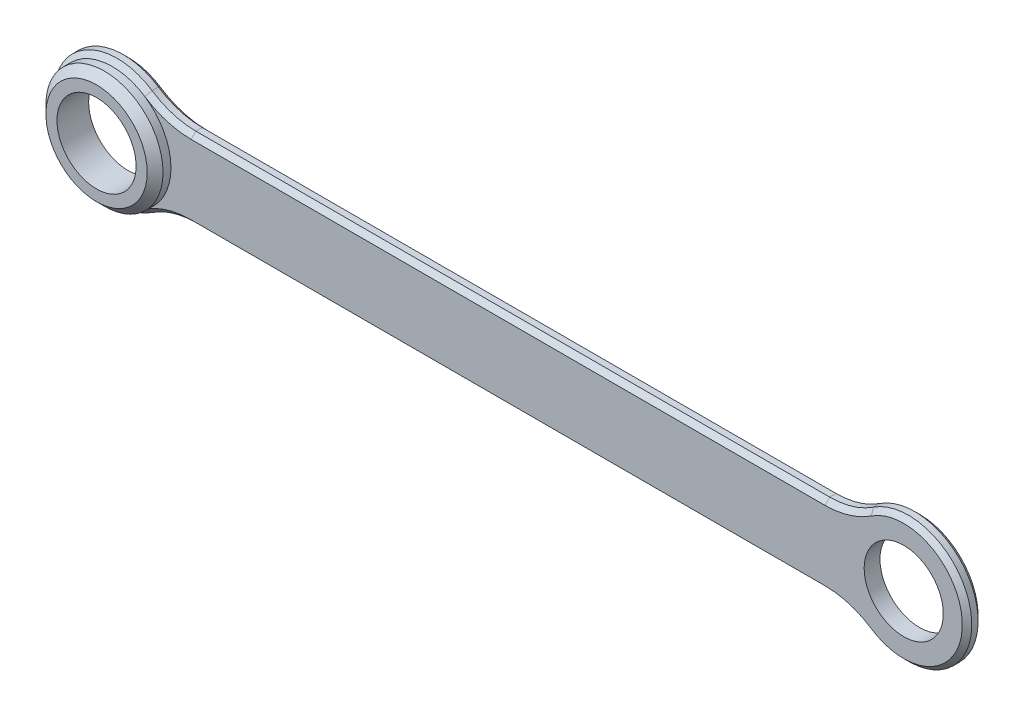
ISO-10303-21;
HEADER;
FILE_DESCRIPTION(('STEP AP214'),'2;1');
FILE_NAME('part.step','',(''),(''),'','','');
FILE_SCHEMA(('AUTOMOTIVE_DESIGN { 1 0 10303 214 1 1 1 1 }'));
ENDSEC;
DATA;
#1=APPLICATION_CONTEXT('core data for automotive mechanical design processes');
#2=APPLICATION_PROTOCOL_DEFINITION('international standard','automotive_design',2000,#1);
#3=PRODUCT_CONTEXT('',#1,'mechanical');
#4=PRODUCT('Part','Part','',(#3));
#5=PRODUCT_RELATED_PRODUCT_CATEGORY('part','',(#4));
#6=PRODUCT_DEFINITION_FORMATION('','',#4);
#7=PRODUCT_DEFINITION_CONTEXT('part definition',#1,'design');
#8=PRODUCT_DEFINITION('design','',#6,#7);
#9=PRODUCT_DEFINITION_SHAPE('','',#8);
#10=(LENGTH_UNIT() NAMED_UNIT(*) SI_UNIT(.MILLI.,.METRE.));
#11=(NAMED_UNIT(*) PLANE_ANGLE_UNIT() SI_UNIT($,.RADIAN.));
#12=(NAMED_UNIT(*) SI_UNIT($,.STERADIAN.) SOLID_ANGLE_UNIT());
#13=UNCERTAINTY_MEASURE_WITH_UNIT(LENGTH_MEASURE(1.E-05),#10,'distance_accuracy_value','');
#14=(GEOMETRIC_REPRESENTATION_CONTEXT(3) GLOBAL_UNCERTAINTY_ASSIGNED_CONTEXT((#13)) GLOBAL_UNIT_ASSIGNED_CONTEXT((#10,
#11,#12)) REPRESENTATION_CONTEXT('',''));
#15=CARTESIAN_POINT('',(0.,0.,0.));
#16=DIRECTION('',(0.,0.,1.));
#17=DIRECTION('',(1.,0.,0.));
#18=AXIS2_PLACEMENT_3D('',#15,#16,#17);
#19=CARTESIAN_POINT('',(0.,0.042307692307692,0.1));
#20=DIRECTION('',(0.,1.,0.));
#21=DIRECTION('',(0.,0.,1.));
#22=AXIS2_PLACEMENT_3D('',#19,#20,#21);
#23=PLANE('',#22);
#24=DIRECTION('',(0.,0.,-1.));
#25=VECTOR('',#24,1.);
#26=CARTESIAN_POINT('',(1.97686525580566,0.042307692307692,0.1));
#27=LINE('',#26,#25);
#28=CARTESIAN_POINT('',(1.97686525580566,0.042307692307692,0.070000000000001));
#29=VERTEX_POINT('',#28);
#30=CARTESIAN_POINT('',(1.97686525580566,0.042307692307692,0.0300000000000012));
#31=VERTEX_POINT('',#30);
#32=EDGE_CURVE('E248',#29,#31,#27,.T.);
#33=ORIENTED_EDGE('',*,*,#32,.T.);
#34=DIRECTION('',(-1.,0.,0.));
#35=VECTOR('',#34,1.);
#36=CARTESIAN_POINT('',(-2.02814730708772,0.042307692307692,0.0300000000000012));
#37=LINE('',#36,#35);
#38=CARTESIAN_POINT('',(-2.02814730708772,0.042307692307692,0.0300000000000012));
#39=VERTEX_POINT('',#38);
#40=EDGE_CURVE('E95',#31,#39,#37,.T.);
#41=ORIENTED_EDGE('',*,*,#40,.T.);
#42=DIRECTION('',(0.,0.,-1.));
#43=VECTOR('',#42,1.);
#44=CARTESIAN_POINT('',(-2.02814730708772,0.042307692307692,0.1));
#45=LINE('',#44,#43);
#46=CARTESIAN_POINT('',(-2.02814730708772,0.042307692307692,0.070000000000001));
#47=VERTEX_POINT('',#46);
#48=EDGE_CURVE('E261',#39,#47,#45,.F.);
#49=ORIENTED_EDGE('',*,*,#48,.T.);
#50=DIRECTION('',(1.,0.,0.));
#51=VECTOR('',#50,1.);
#52=CARTESIAN_POINT('',(0.,0.042307692307692,0.070000000000001));
#53=LINE('',#52,#51);
#54=EDGE_CURVE('E292',#47,#29,#53,.T.);
#55=ORIENTED_EDGE('',*,*,#54,.T.);
#56=EDGE_LOOP('',(#33,#41,#49,#55));
#57=FACE_BOUND('',#56,.T.);
#58=ADVANCED_FACE('F71',(#57),#23,.T.);
#59=CARTESIAN_POINT('',(0.,-0.457692307692308,0.1));
#60=DIRECTION('',(0.,1.,0.));
#61=DIRECTION('',(-1.,0.,0.));
#62=AXIS2_PLACEMENT_3D('',#59,#60,#61);
#63=PLANE('',#62);
#64=DIRECTION('',(0.,0.,1.));
#65=VECTOR('',#64,1.);
#66=CARTESIAN_POINT('',(-2.02814730708772,-0.457692307692308,0.));
#67=LINE('',#66,#65);
#68=CARTESIAN_POINT('',(-2.02814730708772,-0.457692307692308,0.070000000000001));
#69=VERTEX_POINT('',#68);
#70=CARTESIAN_POINT('',(-2.02814730708772,-0.457692307692308,0.0300000000000012));
#71=VERTEX_POINT('',#70);
#72=EDGE_CURVE('E267',#69,#71,#67,.F.);
#73=ORIENTED_EDGE('',*,*,#72,.T.);
#74=DIRECTION('',(1.,0.,0.));
#75=VECTOR('',#74,1.);
#76=CARTESIAN_POINT('',(0.,-0.457692307692308,0.0300000000000012));
#77=LINE('',#76,#75);
#78=CARTESIAN_POINT('',(1.97686525580566,-0.457692307692308,0.0300000000000012));
#79=VERTEX_POINT('',#78);
#80=EDGE_CURVE('E368',#71,#79,#77,.T.);
#81=ORIENTED_EDGE('',*,*,#80,.T.);
#82=DIRECTION('',(0.,0.,1.));
#83=VECTOR('',#82,1.);
#84=CARTESIAN_POINT('',(1.97686525580566,-0.457692307692308,0.1));
#85=LINE('',#84,#83);
#86=CARTESIAN_POINT('',(1.97686525580566,-0.457692307692308,0.070000000000001));
#87=VERTEX_POINT('',#86);
#88=EDGE_CURVE('E264',#79,#87,#85,.T.);
#89=ORIENTED_EDGE('',*,*,#88,.T.);
#90=DIRECTION('',(-1.,0.,0.));
#91=VECTOR('',#90,1.);
#92=CARTESIAN_POINT('',(-2.02814730708772,-0.457692307692308,0.070000000000001));
#93=LINE('',#92,#91);
#94=EDGE_CURVE('E306',#87,#69,#93,.T.);
#95=ORIENTED_EDGE('',*,*,#94,.T.);
#96=EDGE_LOOP('',(#73,#81,#89,#95));
#97=FACE_BOUND('',#96,.T.);
#98=ADVANCED_FACE('F456',(#97),#63,.F.);
#99=CARTESIAN_POINT('',(0.,0.,0.));
#100=DIRECTION('',(0.,0.,1.));
#101=DIRECTION('',(1.,0.,0.));
#102=AXIS2_PLACEMENT_3D('',#99,#100,#101);
#103=PLANE('',#102);
#104=CARTESIAN_POINT('',(2.47435897435897,-0.207692307692308,0.));
#105=DIRECTION('',(0.,0.,1.));
#106=DIRECTION('',(1.,0.,0.));
#107=AXIS2_PLACEMENT_3D('',#104,#105,#106);
#108=CIRCLE('',#107,0.25);
#109=CARTESIAN_POINT('',(2.72435897435897,-0.207692307692308,0.));
#110=VERTEX_POINT('',#109);
#111=EDGE_CURVE('E243',#110,#110,#108,.T.);
#112=ORIENTED_EDGE('',*,*,#111,.T.);
#113=EDGE_LOOP('',(#112));
#114=FACE_BOUND('',#113,.T.);
#115=CARTESIAN_POINT('',(-2.52564102564103,-0.207692307692308,0.));
#116=DIRECTION('',(0.,0.,1.));
#117=DIRECTION('',(1.,0.,0.));
#118=AXIS2_PLACEMENT_3D('',#115,#116,#117);
#119=CIRCLE('',#118,0.25);
#120=CARTESIAN_POINT('',(-2.27564102564103,-0.207692307692308,0.));
#121=VERTEX_POINT('',#120);
#122=EDGE_CURVE('E239',#121,#121,#119,.T.);
#123=ORIENTED_EDGE('',*,*,#122,.T.);
#124=EDGE_LOOP('',(#123));
#125=FACE_BOUND('',#124,.T.);
#126=DIRECTION('',(-1.,0.,0.));
#127=VECTOR('',#126,1.);
#128=CARTESIAN_POINT('',(0.,-0.427692307692306,0.));
#129=LINE('',#128,#127);
#130=CARTESIAN_POINT('',(1.97686525580566,-0.427692307692306,0.));
#131=VERTEX_POINT('',#130);
#132=CARTESIAN_POINT('',(-2.02814730708772,-0.427692307692306,0.));
#133=VERTEX_POINT('',#132);
#134=EDGE_CURVE('E357',#131,#133,#129,.T.);
#135=ORIENTED_EDGE('',*,*,#134,.T.);
#136=CARTESIAN_POINT('',(-2.02814730708772,-0.957692307692308,0.));
#137=DIRECTION('',(0.,0.,1.));
#138=DIRECTION('',(1.,0.,0.));
#139=AXIS2_PLACEMENT_3D('',#136,#137,#138);
#140=CIRCLE('',#139,0.530000000000002);
#141=CARTESIAN_POINT('',(-2.32111583023578,-0.51602564102564,0.));
#142=VERTEX_POINT('',#141);
#143=EDGE_CURVE('E360',#133,#142,#140,.T.);
#144=ORIENTED_EDGE('',*,*,#143,.T.);
#145=CARTESIAN_POINT('',(-2.52564102564103,-0.207692307692308,0.));
#146=DIRECTION('',(0.,0.,1.));
#147=DIRECTION('',(1.,0.,0.));
#148=AXIS2_PLACEMENT_3D('',#145,#146,#147);
#149=CIRCLE('',#148,0.369999999999998);
#150=CARTESIAN_POINT('',(-2.32111583023578,0.100641025641024,0.));
#151=VERTEX_POINT('',#150);
#152=EDGE_CURVE('E315',#142,#151,#149,.F.);
#153=ORIENTED_EDGE('',*,*,#152,.T.);
#154=CARTESIAN_POINT('',(-2.02814730708772,0.542307692307692,0.));
#155=DIRECTION('',(0.,0.,1.));
#156=DIRECTION('',(1.,0.,0.));
#157=AXIS2_PLACEMENT_3D('',#154,#155,#156);
#158=CIRCLE('',#157,0.530000000000002);
#159=CARTESIAN_POINT('',(-2.02814730708772,0.0123076923076902,0.));
#160=VERTEX_POINT('',#159);
#161=EDGE_CURVE('E342',#151,#160,#158,.T.);
#162=ORIENTED_EDGE('',*,*,#161,.T.);
#163=DIRECTION('',(1.,0.,0.));
#164=VECTOR('',#163,1.);
#165=CARTESIAN_POINT('',(1.97686525580566,0.0123076923076902,0.));
#166=LINE('',#165,#164);
#167=CARTESIAN_POINT('',(1.97686525580566,0.0123076923076902,0.));
#168=VERTEX_POINT('',#167);
#169=EDGE_CURVE('E345',#160,#168,#166,.T.);
#170=ORIENTED_EDGE('',*,*,#169,.T.);
#171=CARTESIAN_POINT('',(1.97686525580566,0.542307692307692,0.));
#172=DIRECTION('',(0.,0.,1.));
#173=DIRECTION('',(1.,0.,0.));
#174=AXIS2_PLACEMENT_3D('',#171,#172,#173);
#175=CIRCLE('',#174,0.530000000000002);
#176=CARTESIAN_POINT('',(2.26983377895372,0.100641025641024,0.));
#177=VERTEX_POINT('',#176);
#178=EDGE_CURVE('E348',#168,#177,#175,.T.);
#179=ORIENTED_EDGE('',*,*,#178,.T.);
#180=CARTESIAN_POINT('',(2.47435897435897,-0.207692307692308,0.));
#181=DIRECTION('',(0.,0.,1.));
#182=DIRECTION('',(1.,0.,0.));
#183=AXIS2_PLACEMENT_3D('',#180,#181,#182);
#184=CIRCLE('',#183,0.369999999999998);
#185=CARTESIAN_POINT('',(2.26983377895373,-0.51602564102564,0.));
#186=VERTEX_POINT('',#185);
#187=EDGE_CURVE('E351',#177,#186,#184,.F.);
#188=ORIENTED_EDGE('',*,*,#187,.T.);
#189=CARTESIAN_POINT('',(1.97686525580566,-0.957692307692308,0.));
#190=DIRECTION('',(0.,0.,1.));
#191=DIRECTION('',(1.,0.,0.));
#192=AXIS2_PLACEMENT_3D('',#189,#190,#191);
#193=CIRCLE('',#192,0.530000000000002);
#194=EDGE_CURVE('E354',#186,#131,#193,.T.);
#195=ORIENTED_EDGE('',*,*,#194,.T.);
#196=EDGE_LOOP('',(#135,#144,#153,#162,#170,#179,#188,#195));
#197=FACE_BOUND('',#196,.T.);
#198=ADVANCED_FACE('F493',(#114,#125,#197),#103,.F.);
#199=CARTESIAN_POINT('',(0.,0.,0.1));
#200=DIRECTION('',(0.,0.,1.));
#201=DIRECTION('',(1.,0.,0.));
#202=AXIS2_PLACEMENT_3D('',#199,#200,#201);
#203=PLANE('',#202);
#204=CARTESIAN_POINT('',(-2.52564102564103,-0.207692307692308,0.1));
#205=DIRECTION('',(0.,0.,1.));
#206=DIRECTION('',(1.,0.,0.));
#207=AXIS2_PLACEMENT_3D('',#204,#205,#206);
#208=CIRCLE('',#207,0.370000000000001);
#209=CARTESIAN_POINT('',(-2.32111583023578,-0.516025641025642,0.1));
#210=VERTEX_POINT('',#209);
#211=CARTESIAN_POINT('',(-2.32111583023578,0.100641025641027,0.1));
#212=VERTEX_POINT('',#211);
#213=EDGE_CURVE('E191',#210,#212,#208,.T.);
#214=ORIENTED_EDGE('',*,*,#213,.F.);
#215=CARTESIAN_POINT('',(-2.02814730708772,-0.957692307692308,0.1));
#216=DIRECTION('',(0.,0.,1.));
#217=DIRECTION('',(1.,0.,0.));
#218=AXIS2_PLACEMENT_3D('',#215,#216,#217);
#219=CIRCLE('',#218,0.529999999999999);
#220=CARTESIAN_POINT('',(-2.02814730708772,-0.427692307692309,0.1));
#221=VERTEX_POINT('',#220);
#222=EDGE_CURVE('E214',#210,#221,#219,.F.);
#223=ORIENTED_EDGE('',*,*,#222,.T.);
#224=DIRECTION('',(1.,0.,0.));
#225=VECTOR('',#224,1.);
#226=CARTESIAN_POINT('',(1.97686525580566,-0.427692307692309,0.1));
#227=LINE('',#226,#225);
#228=CARTESIAN_POINT('',(1.97686525580566,-0.427692307692309,0.1));
#229=VERTEX_POINT('',#228);
#230=EDGE_CURVE('E276',#221,#229,#227,.T.);
#231=ORIENTED_EDGE('',*,*,#230,.T.);
#232=CARTESIAN_POINT('',(1.97686525580566,-0.957692307692308,0.1));
#233=DIRECTION('',(0.,0.,1.));
#234=DIRECTION('',(1.,0.,0.));
#235=AXIS2_PLACEMENT_3D('',#232,#233,#234);
#236=CIRCLE('',#235,0.529999999999999);
#237=CARTESIAN_POINT('',(2.26983377895372,-0.516025641025642,0.1));
#238=VERTEX_POINT('',#237);
#239=EDGE_CURVE('E279',#229,#238,#236,.F.);
#240=ORIENTED_EDGE('',*,*,#239,.T.);
#241=CARTESIAN_POINT('',(2.47435897435897,-0.207692307692308,0.1));
#242=DIRECTION('',(0.,0.,1.));
#243=DIRECTION('',(1.,0.,0.));
#244=AXIS2_PLACEMENT_3D('',#241,#242,#243);
#245=CIRCLE('',#244,0.370000000000001);
#246=CARTESIAN_POINT('',(2.26983377895372,0.100641025641027,0.1));
#247=VERTEX_POINT('',#246);
#248=EDGE_CURVE('E282',#238,#247,#245,.T.);
#249=ORIENTED_EDGE('',*,*,#248,.T.);
#250=CARTESIAN_POINT('',(1.97686525580566,0.542307692307692,0.1));
#251=DIRECTION('',(0.,0.,1.));
#252=DIRECTION('',(1.,0.,0.));
#253=AXIS2_PLACEMENT_3D('',#250,#251,#252);
#254=CIRCLE('',#253,0.529999999999999);
#255=CARTESIAN_POINT('',(1.97686525580566,0.0123076923076931,0.1));
#256=VERTEX_POINT('',#255);
#257=EDGE_CURVE('E285',#247,#256,#254,.F.);
#258=ORIENTED_EDGE('',*,*,#257,.T.);
#259=DIRECTION('',(-1.,0.,0.));
#260=VECTOR('',#259,1.);
#261=CARTESIAN_POINT('',(0.,0.0123076923076932,0.1));
#262=LINE('',#261,#260);
#263=CARTESIAN_POINT('',(-2.02814730708772,0.0123076923076932,0.1));
#264=VERTEX_POINT('',#263);
#265=EDGE_CURVE('E194',#256,#264,#262,.T.);
#266=ORIENTED_EDGE('',*,*,#265,.T.);
#267=CARTESIAN_POINT('',(-2.02814730708772,0.542307692307692,0.1));
#268=DIRECTION('',(0.,0.,1.));
#269=DIRECTION('',(1.,0.,0.));
#270=AXIS2_PLACEMENT_3D('',#267,#268,#269);
#271=CIRCLE('',#270,0.529999999999999);
#272=EDGE_CURVE('E186',#264,#212,#271,.F.);
#273=ORIENTED_EDGE('',*,*,#272,.T.);
#274=EDGE_LOOP('',(#214,#223,#231,#240,#249,#258,#266,#273));
#275=FACE_BOUND('',#274,.T.);
#276=CARTESIAN_POINT('',(2.47435897435897,-0.207692307692308,0.1));
#277=DIRECTION('',(0.,0.,-1.));
#278=DIRECTION('',(-1.,0.,0.));
#279=AXIS2_PLACEMENT_3D('',#276,#277,#278);
#280=CIRCLE('',#279,0.25);
#281=CARTESIAN_POINT('',(2.22435897435897,-0.207692307692308,0.1));
#282=VERTEX_POINT('',#281);
#283=EDGE_CURVE('E235',#282,#282,#280,.T.);
#284=ORIENTED_EDGE('',*,*,#283,.T.);
#285=EDGE_LOOP('',(#284));
#286=FACE_BOUND('',#285,.T.);
#287=ADVANCED_FACE('F188',(#275,#286),#203,.T.);
#288=CARTESIAN_POINT('',(2.47435897435897,-0.207692307692308,0.1));
#289=DIRECTION('',(0.,0.,-1.));
#290=DIRECTION('',(-1.,0.,0.));
#291=AXIS2_PLACEMENT_3D('',#288,#289,#290);
#292=CYLINDRICAL_SURFACE('',#291,0.4);
#293=DIRECTION('',(0.,0.,-1.));
#294=VECTOR('',#293,1.);
#295=CARTESIAN_POINT('',(2.25325065500195,-0.541025641025642,0.1));
#296=LINE('',#295,#294);
#297=CARTESIAN_POINT('',(2.25325065500195,-0.541025641025642,0.070000000000001));
#298=VERTEX_POINT('',#297);
#299=CARTESIAN_POINT('',(2.25325065500195,-0.541025641025642,0.0300000000000012));
#300=VERTEX_POINT('',#299);
#301=EDGE_CURVE('E215',#298,#300,#296,.T.);
#302=ORIENTED_EDGE('',*,*,#301,.T.);
#303=CARTESIAN_POINT('',(2.47435897435897,-0.207692307692308,0.0300000000000012));
#304=DIRECTION('',(0.,0.,1.));
#305=DIRECTION('',(1.,0.,0.));
#306=AXIS2_PLACEMENT_3D('',#303,#304,#305);
#307=CIRCLE('',#306,0.4);
#308=CARTESIAN_POINT('',(2.25325065500195,0.125641025641025,0.0300000000000012));
#309=VERTEX_POINT('',#308);
#310=EDGE_CURVE('E374',#300,#309,#307,.T.);
#311=ORIENTED_EDGE('',*,*,#310,.T.);
#312=DIRECTION('',(0.,0.,-1.));
#313=VECTOR('',#312,1.);
#314=CARTESIAN_POINT('',(2.25325065500195,0.125641025641025,0.1));
#315=LINE('',#314,#313);
#316=CARTESIAN_POINT('',(2.25325065500195,0.125641025641025,0.070000000000001));
#317=VERTEX_POINT('',#316);
#318=EDGE_CURVE('E251',#309,#317,#315,.F.);
#319=ORIENTED_EDGE('',*,*,#318,.T.);
#320=CARTESIAN_POINT('',(2.47435897435897,-0.207692307692308,0.070000000000001));
#321=DIRECTION('',(0.,0.,1.));
#322=DIRECTION('',(1.,0.,0.));
#323=AXIS2_PLACEMENT_3D('',#320,#321,#322);
#324=CIRCLE('',#323,0.4);
#325=EDGE_CURVE('E299',#317,#298,#324,.F.);
#326=ORIENTED_EDGE('',*,*,#325,.T.);
#327=EDGE_LOOP('',(#302,#311,#319,#326));
#328=FACE_BOUND('',#327,.T.);
#329=ADVANCED_FACE('F481',(#328),#292,.T.);
#330=CARTESIAN_POINT('',(-2.52564102564103,-0.207692307692308,0.1));
#331=DIRECTION('',(0.,0.,-1.));
#332=DIRECTION('',(-1.,0.,0.));
#333=AXIS2_PLACEMENT_3D('',#330,#331,#332);
#334=CYLINDRICAL_SURFACE('',#333,0.4);
#335=DIRECTION('',(0.,0.,-1.));
#336=VECTOR('',#335,1.);
#337=CARTESIAN_POINT('',(-2.304532706284,0.125641025641025,0.1));
#338=LINE('',#337,#336);
#339=CARTESIAN_POINT('',(-2.304532706284,0.125641025641025,0.070000000000001));
#340=VERTEX_POINT('',#339);
#341=CARTESIAN_POINT('',(-2.304532706284,0.125641025641025,0.0300000000000012));
#342=VERTEX_POINT('',#341);
#343=EDGE_CURVE('E258',#340,#342,#338,.T.);
#344=ORIENTED_EDGE('',*,*,#343,.T.);
#345=CARTESIAN_POINT('',(-2.52564102564103,-0.207692307692308,0.0300000000000012));
#346=DIRECTION('',(0.,0.,1.));
#347=DIRECTION('',(1.,0.,0.));
#348=AXIS2_PLACEMENT_3D('',#345,#346,#347);
#349=CIRCLE('',#348,0.4);
#350=CARTESIAN_POINT('',(-2.304532706284,-0.541025641025641,0.0300000000000012));
#351=VERTEX_POINT('',#350);
#352=EDGE_CURVE('E226',#342,#351,#349,.T.);
#353=ORIENTED_EDGE('',*,*,#352,.T.);
#354=DIRECTION('',(0.,0.,-1.));
#355=VECTOR('',#354,1.);
#356=CARTESIAN_POINT('',(-2.304532706284,-0.541025641025641,0.1));
#357=LINE('',#356,#355);
#358=CARTESIAN_POINT('',(-2.304532706284,-0.541025641025641,0.070000000000001));
#359=VERTEX_POINT('',#358);
#360=EDGE_CURVE('E255',#351,#359,#357,.F.);
#361=ORIENTED_EDGE('',*,*,#360,.T.);
#362=CARTESIAN_POINT('',(-2.52564102564103,-0.207692307692308,0.070000000000001));
#363=DIRECTION('',(0.,0.,1.));
#364=DIRECTION('',(1.,0.,0.));
#365=AXIS2_PLACEMENT_3D('',#362,#363,#364);
#366=CIRCLE('',#365,0.4);
#367=EDGE_CURVE('E313',#359,#340,#366,.F.);
#368=ORIENTED_EDGE('',*,*,#367,.T.);
#369=EDGE_LOOP('',(#344,#353,#361,#368));
#370=FACE_BOUND('',#369,.T.);
#371=ADVANCED_FACE('F435',(#370),#334,.T.);
#372=CARTESIAN_POINT('',(1.97686525580566,0.542307692307692,0.1));
#373=DIRECTION('',(0.,0.,-1.));
#374=DIRECTION('',(-1.,0.,0.));
#375=AXIS2_PLACEMENT_3D('',#372,#373,#374);
#376=CYLINDRICAL_SURFACE('',#375,0.5);
#377=ORIENTED_EDGE('',*,*,#318,.F.);
#378=CARTESIAN_POINT('',(1.97686525580566,0.542307692307692,0.0300000000000012));
#379=DIRECTION('',(0.,0.,1.));
#380=DIRECTION('',(1.,0.,0.));
#381=AXIS2_PLACEMENT_3D('',#378,#379,#380);
#382=CIRCLE('',#381,0.5);
#383=EDGE_CURVE('E377',#309,#31,#382,.F.);
#384=ORIENTED_EDGE('',*,*,#383,.T.);
#385=ORIENTED_EDGE('',*,*,#32,.F.);
#386=CARTESIAN_POINT('',(1.97686525580566,0.542307692307692,0.070000000000001));
#387=DIRECTION('',(0.,0.,1.));
#388=DIRECTION('',(1.,0.,0.));
#389=AXIS2_PLACEMENT_3D('',#386,#387,#388);
#390=CIRCLE('',#389,0.5);
#391=EDGE_CURVE('E295',#29,#317,#390,.T.);
#392=ORIENTED_EDGE('',*,*,#391,.T.);
#393=EDGE_LOOP('',(#377,#384,#385,#392));
#394=FACE_BOUND('',#393,.T.);
#395=ADVANCED_FACE('F425',(#394),#376,.F.);
#396=CARTESIAN_POINT('',(-2.02814730708772,0.542307692307692,0.1));
#397=DIRECTION('',(0.,0.,-1.));
#398=DIRECTION('',(-1.,0.,0.));
#399=AXIS2_PLACEMENT_3D('',#396,#397,#398);
#400=CYLINDRICAL_SURFACE('',#399,0.5);
#401=ORIENTED_EDGE('',*,*,#48,.F.);
#402=CARTESIAN_POINT('',(-2.02814730708772,0.542307692307692,0.0300000000000012));
#403=DIRECTION('',(0.,0.,1.));
#404=DIRECTION('',(1.,0.,0.));
#405=AXIS2_PLACEMENT_3D('',#402,#403,#404);
#406=CIRCLE('',#405,0.5);
#407=EDGE_CURVE('E87',#39,#342,#406,.F.);
#408=ORIENTED_EDGE('',*,*,#407,.T.);
#409=ORIENTED_EDGE('',*,*,#343,.F.);
#410=CARTESIAN_POINT('',(-2.02814730708772,0.542307692307692,0.070000000000001));
#411=DIRECTION('',(0.,0.,1.));
#412=DIRECTION('',(1.,0.,0.));
#413=AXIS2_PLACEMENT_3D('',#410,#411,#412);
#414=CIRCLE('',#413,0.5);
#415=EDGE_CURVE('E200',#340,#47,#414,.T.);
#416=ORIENTED_EDGE('',*,*,#415,.T.);
#417=EDGE_LOOP('',(#401,#408,#409,#416));
#418=FACE_BOUND('',#417,.T.);
#419=ADVANCED_FACE('F431',(#418),#400,.F.);
#420=CARTESIAN_POINT('',(-2.02814730708772,-0.957692307692308,0.1));
#421=DIRECTION('',(0.,0.,-1.));
#422=DIRECTION('',(-1.,0.,0.));
#423=AXIS2_PLACEMENT_3D('',#420,#421,#422);
#424=CYLINDRICAL_SURFACE('',#423,0.5);
#425=ORIENTED_EDGE('',*,*,#360,.F.);
#426=CARTESIAN_POINT('',(-2.02814730708772,-0.957692307692308,0.0300000000000012));
#427=DIRECTION('',(0.,0.,1.));
#428=DIRECTION('',(1.,0.,0.));
#429=AXIS2_PLACEMENT_3D('',#426,#427,#428);
#430=CIRCLE('',#429,0.5);
#431=EDGE_CURVE('E364',#351,#71,#430,.F.);
#432=ORIENTED_EDGE('',*,*,#431,.T.);
#433=ORIENTED_EDGE('',*,*,#72,.F.);
#434=CARTESIAN_POINT('',(-2.02814730708772,-0.957692307692308,0.070000000000001));
#435=DIRECTION('',(0.,0.,1.));
#436=DIRECTION('',(1.,0.,0.));
#437=AXIS2_PLACEMENT_3D('',#434,#435,#436);
#438=CIRCLE('',#437,0.5);
#439=EDGE_CURVE('E309',#69,#359,#438,.T.);
#440=ORIENTED_EDGE('',*,*,#439,.T.);
#441=EDGE_LOOP('',(#425,#432,#433,#440));
#442=FACE_BOUND('',#441,.T.);
#443=ADVANCED_FACE('F453',(#442),#424,.F.);
#444=CARTESIAN_POINT('',(1.97686525580566,-0.957692307692308,0.1));
#445=DIRECTION('',(0.,0.,-1.));
#446=DIRECTION('',(-1.,0.,0.));
#447=AXIS2_PLACEMENT_3D('',#444,#445,#446);
#448=CYLINDRICAL_SURFACE('',#447,0.5);
#449=ORIENTED_EDGE('',*,*,#88,.F.);
#450=CARTESIAN_POINT('',(1.97686525580566,-0.957692307692308,0.0300000000000012));
#451=DIRECTION('',(0.,0.,1.));
#452=DIRECTION('',(1.,0.,0.));
#453=AXIS2_PLACEMENT_3D('',#450,#451,#452);
#454=CIRCLE('',#453,0.5);
#455=EDGE_CURVE('E371',#79,#300,#454,.F.);
#456=ORIENTED_EDGE('',*,*,#455,.T.);
#457=ORIENTED_EDGE('',*,*,#301,.F.);
#458=CARTESIAN_POINT('',(1.97686525580566,-0.957692307692308,0.070000000000001));
#459=DIRECTION('',(0.,0.,1.));
#460=DIRECTION('',(1.,0.,0.));
#461=AXIS2_PLACEMENT_3D('',#458,#459,#460);
#462=CIRCLE('',#461,0.5);
#463=EDGE_CURVE('E302',#298,#87,#462,.T.);
#464=ORIENTED_EDGE('',*,*,#463,.T.);
#465=EDGE_LOOP('',(#449,#456,#457,#464));
#466=FACE_BOUND('',#465,.T.);
#467=ADVANCED_FACE('F483',(#466),#448,.F.);
#468=CARTESIAN_POINT('',(1.97686525580566,-0.957692307692308,0.1));
#469=DIRECTION('',(0.,0.,1.));
#470=DIRECTION('',(1.,0.,0.));
#471=AXIS2_PLACEMENT_3D('',#468,#469,#470);
#472=CONICAL_SURFACE('',#471,0.529999999999999,0.785398163397445);
#473=DIRECTION('',(0.,0.707106781186545,0.70710678118655));
#474=VECTOR('',#473,1.);
#475=CARTESIAN_POINT('',(1.97686525580566,-0.457692307692308,0.070000000000001));
#476=LINE('',#475,#474);
#477=EDGE_CURVE('E333',#87,#229,#476,.T.);
#478=ORIENTED_EDGE('',*,*,#477,.F.);
#479=ORIENTED_EDGE('',*,*,#463,.F.);
#480=DIRECTION('',(-0.390867979985288,-0.589255650988785,-0.70710678118655));
#481=VECTOR('',#480,1.);
#482=CARTESIAN_POINT('',(2.26983377895372,-0.516025641025642,0.1));
#483=LINE('',#482,#481);
#484=EDGE_CURVE('E252',#238,#298,#483,.T.);
#485=ORIENTED_EDGE('',*,*,#484,.F.);
#486=ORIENTED_EDGE('',*,*,#239,.F.);
#487=EDGE_LOOP('',(#478,#479,#485,#486));
#488=FACE_BOUND('',#487,.T.);
#489=ADVANCED_FACE('F469',(#488),#472,.F.);
#490=CARTESIAN_POINT('',(2.47435897435897,-0.207692307692308,0.1));
#491=DIRECTION('',(0.,0.,-1.));
#492=DIRECTION('',(-1.,0.,0.));
#493=AXIS2_PLACEMENT_3D('',#490,#491,#492);
#494=CONICAL_SURFACE('',#493,0.370000000000001,0.785398163397445);
#495=ORIENTED_EDGE('',*,*,#484,.T.);
#496=ORIENTED_EDGE('',*,*,#325,.F.);
#497=DIRECTION('',(-0.390867979985288,0.589255650988785,-0.70710678118655));
#498=VECTOR('',#497,1.);
#499=CARTESIAN_POINT('',(2.26983377895372,0.100641025641027,0.1));
#500=LINE('',#499,#498);
#501=EDGE_CURVE('E329',#247,#317,#500,.T.);
#502=ORIENTED_EDGE('',*,*,#501,.F.);
#503=ORIENTED_EDGE('',*,*,#248,.F.);
#504=EDGE_LOOP('',(#495,#496,#502,#503));
#505=FACE_BOUND('',#504,.T.);
#506=ADVANCED_FACE('F475',(#505),#494,.T.);
#507=CARTESIAN_POINT('',(0.,-0.427692307692309,0.1));
#508=DIRECTION('',(0.,-0.70710678118655,0.707106781186545));
#509=DIRECTION('',(-1.,0.,0.));
#510=AXIS2_PLACEMENT_3D('',#507,#508,#509);
#511=PLANE('',#510);
#512=ORIENTED_EDGE('',*,*,#477,.T.);
#513=ORIENTED_EDGE('',*,*,#230,.F.);
#514=DIRECTION('',(0.,0.707106781186545,0.70710678118655));
#515=VECTOR('',#514,1.);
#516=CARTESIAN_POINT('',(-2.02814730708772,-0.457692307692308,0.070000000000001));
#517=LINE('',#516,#515);
#518=EDGE_CURVE('E325',#69,#221,#517,.T.);
#519=ORIENTED_EDGE('',*,*,#518,.F.);
#520=ORIENTED_EDGE('',*,*,#94,.F.);
#521=EDGE_LOOP('',(#512,#513,#519,#520));
#522=FACE_BOUND('',#521,.T.);
#523=ADVANCED_FACE('F460',(#522),#511,.T.);
#524=CARTESIAN_POINT('',(1.97686525580566,0.542307692307692,0.1));
#525=DIRECTION('',(0.,0.,1.));
#526=DIRECTION('',(1.,0.,0.));
#527=AXIS2_PLACEMENT_3D('',#524,#525,#526);
#528=CONICAL_SURFACE('',#527,0.529999999999999,0.785398163397445);
#529=ORIENTED_EDGE('',*,*,#501,.T.);
#530=ORIENTED_EDGE('',*,*,#391,.F.);
#531=DIRECTION('',(0.,0.707106781186546,-0.707106781186549));
#532=VECTOR('',#531,1.);
#533=CARTESIAN_POINT('',(1.97686525580566,0.0123076923076931,0.1));
#534=LINE('',#533,#532);
#535=EDGE_CURVE('E321',#256,#29,#534,.T.);
#536=ORIENTED_EDGE('',*,*,#535,.F.);
#537=ORIENTED_EDGE('',*,*,#257,.F.);
#538=EDGE_LOOP('',(#529,#530,#536,#537));
#539=FACE_BOUND('',#538,.T.);
#540=ADVANCED_FACE('F478',(#539),#528,.F.);
#541=CARTESIAN_POINT('',(-2.02814730708772,-0.957692307692308,0.1));
#542=DIRECTION('',(0.,0.,1.));
#543=DIRECTION('',(1.,0.,0.));
#544=AXIS2_PLACEMENT_3D('',#541,#542,#543);
#545=CONICAL_SURFACE('',#544,0.529999999999999,0.785398163397445);
#546=ORIENTED_EDGE('',*,*,#518,.T.);
#547=ORIENTED_EDGE('',*,*,#222,.F.);
#548=DIRECTION('',(-0.390867979985288,0.589255650988787,0.707106781186549));
#549=VECTOR('',#548,1.);
#550=CARTESIAN_POINT('',(-2.304532706284,-0.541025641025641,0.070000000000001));
#551=LINE('',#550,#549);
#552=EDGE_CURVE('E211',#359,#210,#551,.T.);
#553=ORIENTED_EDGE('',*,*,#552,.F.);
#554=ORIENTED_EDGE('',*,*,#439,.F.);
#555=EDGE_LOOP('',(#546,#547,#553,#554));
#556=FACE_BOUND('',#555,.T.);
#557=ADVANCED_FACE('F465',(#556),#545,.F.);
#558=CARTESIAN_POINT('',(0.,0.042307692307692,0.070000000000001));
#559=DIRECTION('',(0.,-0.70710678118655,-0.707106781186545));
#560=DIRECTION('',(1.,0.,0.));
#561=AXIS2_PLACEMENT_3D('',#558,#559,#560);
#562=PLANE('',#561);
#563=ORIENTED_EDGE('',*,*,#535,.T.);
#564=ORIENTED_EDGE('',*,*,#54,.F.);
#565=DIRECTION('',(0.,0.707106781186545,-0.70710678118655));
#566=VECTOR('',#565,1.);
#567=CARTESIAN_POINT('',(-2.02814730708772,0.0123076923076932,0.1));
#568=LINE('',#567,#566);
#569=EDGE_CURVE('E221',#264,#47,#568,.T.);
#570=ORIENTED_EDGE('',*,*,#569,.F.);
#571=ORIENTED_EDGE('',*,*,#265,.F.);
#572=EDGE_LOOP('',(#563,#564,#570,#571));
#573=FACE_BOUND('',#572,.T.);
#574=ADVANCED_FACE('F429',(#573),#562,.F.);
#575=CARTESIAN_POINT('',(-2.52564102564103,-0.207692307692308,0.1));
#576=DIRECTION('',(0.,0.,-1.));
#577=DIRECTION('',(-1.,0.,0.));
#578=AXIS2_PLACEMENT_3D('',#575,#576,#577);
#579=CONICAL_SURFACE('',#578,0.370000000000001,0.785398163397446);
#580=ORIENTED_EDGE('',*,*,#552,.T.);
#581=CARTESIAN_POINT('',(-2.52564102564103,-0.207692307692308,0.1));
#582=DIRECTION('',(0.,0.,1.));
#583=DIRECTION('',(1.,0.,0.));
#584=AXIS2_PLACEMENT_3D('',#581,#582,#583);
#585=CIRCLE('',#584,0.370000000000001);
#586=EDGE_CURVE('E206',#212,#210,#585,.T.);
#587=ORIENTED_EDGE('',*,*,#586,.F.);
#588=DIRECTION('',(-0.390867979985288,-0.589255650988785,0.70710678118655));
#589=VECTOR('',#588,1.);
#590=CARTESIAN_POINT('',(-2.304532706284,0.125641025641025,0.070000000000001));
#591=LINE('',#590,#589);
#592=EDGE_CURVE('E209',#340,#212,#591,.T.);
#593=ORIENTED_EDGE('',*,*,#592,.F.);
#594=ORIENTED_EDGE('',*,*,#367,.F.);
#595=EDGE_LOOP('',(#580,#587,#593,#594));
#596=FACE_BOUND('',#595,.T.);
#597=ADVANCED_FACE('F207',(#596),#579,.T.);
#598=CARTESIAN_POINT('',(-2.02814730708772,0.542307692307692,0.1));
#599=DIRECTION('',(0.,0.,1.));
#600=DIRECTION('',(1.,0.,0.));
#601=AXIS2_PLACEMENT_3D('',#598,#599,#600);
#602=CONICAL_SURFACE('',#601,0.529999999999999,0.785398163397445);
#603=ORIENTED_EDGE('',*,*,#569,.T.);
#604=ORIENTED_EDGE('',*,*,#415,.F.);
#605=ORIENTED_EDGE('',*,*,#592,.T.);
#606=ORIENTED_EDGE('',*,*,#272,.F.);
#607=EDGE_LOOP('',(#603,#604,#605,#606));
#608=FACE_BOUND('',#607,.T.);
#609=ADVANCED_FACE('F218',(#608),#602,.F.);
#610=CARTESIAN_POINT('',(1.97686525580566,0.542307692307692,0.));
#611=DIRECTION('',(0.,0.,-1.));
#612=DIRECTION('',(-1.,0.,0.));
#613=AXIS2_PLACEMENT_3D('',#610,#611,#612);
#614=CONICAL_SURFACE('',#613,0.530000000000002,0.785398163397459);
#615=DIRECTION('',(0.,-0.707106781186555,-0.70710678118654));
#616=VECTOR('',#615,1.);
#617=CARTESIAN_POINT('',(1.97686525580566,0.042307692307692,0.0300000000000012));
#618=LINE('',#617,#616);
#619=EDGE_CURVE('E405',#31,#168,#618,.T.);
#620=ORIENTED_EDGE('',*,*,#619,.F.);
#621=ORIENTED_EDGE('',*,*,#383,.F.);
#622=DIRECTION('',(-0.390867979985286,0.589255650988797,0.707106781186541));
#623=VECTOR('',#622,1.);
#624=CARTESIAN_POINT('',(2.26983377895372,0.100641025641024,0.));
#625=LINE('',#624,#623);
#626=EDGE_CURVE('E222',#177,#309,#625,.T.);
#627=ORIENTED_EDGE('',*,*,#626,.F.);
#628=ORIENTED_EDGE('',*,*,#178,.F.);
#629=EDGE_LOOP('',(#620,#621,#627,#628));
#630=FACE_BOUND('',#629,.T.);
#631=ADVANCED_FACE('F421',(#630),#614,.F.);
#632=CARTESIAN_POINT('',(2.47435897435897,-0.207692307692308,0.0300000000000012));
#633=DIRECTION('',(0.,0.,1.));
#634=DIRECTION('',(1.,0.,0.));
#635=AXIS2_PLACEMENT_3D('',#632,#633,#634);
#636=CONICAL_SURFACE('',#635,0.4,0.785398163397459);
#637=ORIENTED_EDGE('',*,*,#626,.T.);
#638=ORIENTED_EDGE('',*,*,#310,.F.);
#639=DIRECTION('',(-0.390867979985286,-0.589255650988798,0.707106781186541));
#640=VECTOR('',#639,1.);
#641=CARTESIAN_POINT('',(2.26983377895373,-0.51602564102564,0.));
#642=LINE('',#641,#640);
#643=EDGE_CURVE('E401',#186,#300,#642,.T.);
#644=ORIENTED_EDGE('',*,*,#643,.F.);
#645=ORIENTED_EDGE('',*,*,#187,.F.);
#646=EDGE_LOOP('',(#637,#638,#644,#645));
#647=FACE_BOUND('',#646,.T.);
#648=ADVANCED_FACE('F415',(#647),#636,.T.);
#649=CARTESIAN_POINT('',(0.,0.0123076923076902,0.));
#650=DIRECTION('',(0.,0.70710678118654,-0.707106781186555));
#651=DIRECTION('',(-1.,0.,0.));
#652=AXIS2_PLACEMENT_3D('',#649,#650,#651);
#653=PLANE('',#652);
#654=ORIENTED_EDGE('',*,*,#619,.T.);
#655=ORIENTED_EDGE('',*,*,#169,.F.);
#656=DIRECTION('',(0.,-0.707106781186555,-0.70710678118654));
#657=VECTOR('',#656,1.);
#658=CARTESIAN_POINT('',(-2.02814730708772,0.042307692307692,0.0300000000000012));
#659=LINE('',#658,#657);
#660=EDGE_CURVE('E397',#39,#160,#659,.T.);
#661=ORIENTED_EDGE('',*,*,#660,.F.);
#662=ORIENTED_EDGE('',*,*,#40,.F.);
#663=EDGE_LOOP('',(#654,#655,#661,#662));
#664=FACE_BOUND('',#663,.T.);
#665=ADVANCED_FACE('F496',(#664),#653,.T.);
#666=CARTESIAN_POINT('',(1.97686525580566,-0.957692307692308,0.));
#667=DIRECTION('',(0.,0.,-1.));
#668=DIRECTION('',(-1.,0.,0.));
#669=AXIS2_PLACEMENT_3D('',#666,#667,#668);
#670=CONICAL_SURFACE('',#669,0.530000000000002,0.785398163397459);
#671=ORIENTED_EDGE('',*,*,#643,.T.);
#672=ORIENTED_EDGE('',*,*,#455,.F.);
#673=DIRECTION('',(0.,-0.707106781186555,0.70710678118654));
#674=VECTOR('',#673,1.);
#675=CARTESIAN_POINT('',(1.97686525580566,-0.427692307692306,0.));
#676=LINE('',#675,#674);
#677=EDGE_CURVE('E393',#131,#79,#676,.T.);
#678=ORIENTED_EDGE('',*,*,#677,.F.);
#679=ORIENTED_EDGE('',*,*,#194,.F.);
#680=EDGE_LOOP('',(#671,#672,#678,#679));
#681=FACE_BOUND('',#680,.T.);
#682=ADVANCED_FACE('F487',(#681),#670,.F.);
#683=CARTESIAN_POINT('',(-2.02814730708772,0.542307692307692,0.));
#684=DIRECTION('',(0.,0.,-1.));
#685=DIRECTION('',(-1.,0.,0.));
#686=AXIS2_PLACEMENT_3D('',#683,#684,#685);
#687=CONICAL_SURFACE('',#686,0.530000000000002,0.785398163397457);
#688=ORIENTED_EDGE('',*,*,#660,.T.);
#689=ORIENTED_EDGE('',*,*,#161,.F.);
#690=DIRECTION('',(-0.390867979985286,-0.589255650988796,-0.707106781186542));
#691=VECTOR('',#690,1.);
#692=CARTESIAN_POINT('',(-2.304532706284,0.125641025641025,0.0300000000000012));
#693=LINE('',#692,#691);
#694=EDGE_CURVE('E389',#342,#151,#693,.T.);
#695=ORIENTED_EDGE('',*,*,#694,.F.);
#696=ORIENTED_EDGE('',*,*,#407,.F.);
#697=EDGE_LOOP('',(#688,#689,#695,#696));
#698=FACE_BOUND('',#697,.T.);
#699=ADVANCED_FACE('F440',(#698),#687,.F.);
#700=CARTESIAN_POINT('',(0.,-0.457692307692308,0.0300000000000012));
#701=DIRECTION('',(0.,0.70710678118654,0.707106781186555));
#702=DIRECTION('',(1.,0.,0.));
#703=AXIS2_PLACEMENT_3D('',#700,#701,#702);
#704=PLANE('',#703);
#705=ORIENTED_EDGE('',*,*,#677,.T.);
#706=ORIENTED_EDGE('',*,*,#80,.F.);
#707=DIRECTION('',(0.,-0.707106781186555,0.70710678118654));
#708=VECTOR('',#707,1.);
#709=CARTESIAN_POINT('',(-2.02814730708772,-0.427692307692306,0.));
#710=LINE('',#709,#708);
#711=EDGE_CURVE('E386',#133,#71,#710,.T.);
#712=ORIENTED_EDGE('',*,*,#711,.F.);
#713=ORIENTED_EDGE('',*,*,#134,.F.);
#714=EDGE_LOOP('',(#705,#706,#712,#713));
#715=FACE_BOUND('',#714,.T.);
#716=ADVANCED_FACE('F491',(#715),#704,.F.);
#717=CARTESIAN_POINT('',(-2.52564102564103,-0.207692307692308,0.0300000000000012));
#718=DIRECTION('',(0.,0.,1.));
#719=DIRECTION('',(1.,0.,0.));
#720=AXIS2_PLACEMENT_3D('',#717,#718,#719);
#721=CONICAL_SURFACE('',#720,0.4,0.785398163397457);
#722=ORIENTED_EDGE('',*,*,#694,.T.);
#723=ORIENTED_EDGE('',*,*,#152,.F.);
#724=DIRECTION('',(-0.390867979985286,0.589255650988798,-0.70710678118654));
#725=VECTOR('',#724,1.);
#726=CARTESIAN_POINT('',(-2.304532706284,-0.541025641025641,0.0300000000000012));
#727=LINE('',#726,#725);
#728=EDGE_CURVE('E247',#351,#142,#727,.T.);
#729=ORIENTED_EDGE('',*,*,#728,.F.);
#730=ORIENTED_EDGE('',*,*,#352,.F.);
#731=EDGE_LOOP('',(#722,#723,#729,#730));
#732=FACE_BOUND('',#731,.T.);
#733=ADVANCED_FACE('F444',(#732),#721,.T.);
#734=CARTESIAN_POINT('',(-2.02814730708772,-0.957692307692308,0.));
#735=DIRECTION('',(0.,0.,-1.));
#736=DIRECTION('',(-1.,0.,0.));
#737=AXIS2_PLACEMENT_3D('',#734,#735,#736);
#738=CONICAL_SURFACE('',#737,0.530000000000002,0.785398163397459);
#739=ORIENTED_EDGE('',*,*,#711,.T.);
#740=ORIENTED_EDGE('',*,*,#431,.F.);
#741=ORIENTED_EDGE('',*,*,#728,.T.);
#742=ORIENTED_EDGE('',*,*,#143,.F.);
#743=EDGE_LOOP('',(#739,#740,#741,#742));
#744=FACE_BOUND('',#743,.T.);
#745=ADVANCED_FACE('F448',(#744),#738,.F.);
#746=CARTESIAN_POINT('',(-2.52564102564103,-0.207692307692308,0.1));
#747=DIRECTION('',(0.,0.,-1.));
#748=DIRECTION('',(-1.,0.,0.));
#749=AXIS2_PLACEMENT_3D('',#746,#747,#748);
#750=CYLINDRICAL_SURFACE('',#749,0.25);
#751=ORIENTED_EDGE('',*,*,#122,.F.);
#752=EDGE_LOOP('',(#751));
#753=FACE_BOUND('',#752,.T.);
#754=CARTESIAN_POINT('',(-2.52564102564103,-0.207692307692308,0.2));
#755=DIRECTION('',(0.,0.,-1.));
#756=DIRECTION('',(-1.,0.,0.));
#757=AXIS2_PLACEMENT_3D('',#754,#755,#756);
#758=CIRCLE('',#757,0.25);
#759=CARTESIAN_POINT('',(-2.77564102564103,-0.207692307692308,0.2));
#760=VERTEX_POINT('',#759);
#761=EDGE_CURVE('E234',#760,#760,#758,.T.);
#762=ORIENTED_EDGE('',*,*,#761,.F.);
#763=EDGE_LOOP('',(#762));
#764=FACE_BOUND('',#763,.T.);
#765=ADVANCED_FACE('F543',(#753,#764),#750,.F.);
#766=CARTESIAN_POINT('',(2.47435897435897,-0.207692307692308,0.1));
#767=DIRECTION('',(0.,0.,-1.));
#768=DIRECTION('',(-1.,0.,0.));
#769=AXIS2_PLACEMENT_3D('',#766,#767,#768);
#770=CYLINDRICAL_SURFACE('',#769,0.25);
#771=ORIENTED_EDGE('',*,*,#283,.F.);
#772=EDGE_LOOP('',(#771));
#773=FACE_BOUND('',#772,.T.);
#774=ORIENTED_EDGE('',*,*,#111,.F.);
#775=EDGE_LOOP('',(#774));
#776=FACE_BOUND('',#775,.T.);
#777=ADVANCED_FACE('F569',(#773,#776),#770,.F.);
#778=CARTESIAN_POINT('',(-2.52564102564103,-0.207692307692308,0.2));
#779=DIRECTION('',(0.,0.,1.));
#780=DIRECTION('',(1.,0.,0.));
#781=AXIS2_PLACEMENT_3D('',#778,#779,#780);
#782=PLANE('',#781);
#783=CARTESIAN_POINT('',(-2.52564102564103,-0.207692307692308,0.2));
#784=DIRECTION('',(0.,0.,1.));
#785=DIRECTION('',(1.,0.,0.));
#786=AXIS2_PLACEMENT_3D('',#783,#784,#785);
#787=CIRCLE('',#786,0.320000000000002);
#788=CARTESIAN_POINT('',(-2.20564102564102,-0.207692307692308,0.2));
#789=VERTEX_POINT('',#788);
#790=EDGE_CURVE('E80',#789,#789,#787,.T.);
#791=ORIENTED_EDGE('',*,*,#790,.T.);
#792=EDGE_LOOP('',(#791));
#793=FACE_BOUND('',#792,.T.);
#794=ORIENTED_EDGE('',*,*,#761,.T.);
#795=EDGE_LOOP('',(#794));
#796=FACE_BOUND('',#795,.T.);
#797=ADVANCED_FACE('F573',(#793,#796),#782,.T.);
#798=CARTESIAN_POINT('',(-2.52564102564103,-0.207692307692308,0.2));
#799=DIRECTION('',(0.,0.,-1.));
#800=DIRECTION('',(-1.,0.,0.));
#801=AXIS2_PLACEMENT_3D('',#798,#799,#800);
#802=CYLINDRICAL_SURFACE('',#801,0.370000000000001);
#803=CARTESIAN_POINT('',(-2.52564102564103,-0.207692307692308,0.150000000000001));
#804=DIRECTION('',(0.,0.,1.));
#805=DIRECTION('',(1.,0.,0.));
#806=AXIS2_PLACEMENT_3D('',#803,#804,#805);
#807=CIRCLE('',#806,0.370000000000001);
#808=CARTESIAN_POINT('',(-2.15564102564102,-0.207692307692308,0.150000000000001));
#809=VERTEX_POINT('',#808);
#810=EDGE_CURVE('E12',#809,#809,#807,.F.);
#811=ORIENTED_EDGE('',*,*,#810,.T.);
#812=EDGE_LOOP('',(#811));
#813=FACE_BOUND('',#812,.T.);
#814=ORIENTED_EDGE('',*,*,#586,.T.);
#815=ORIENTED_EDGE('',*,*,#213,.T.);
#816=EDGE_LOOP('',(#814,#815));
#817=FACE_BOUND('',#816,.T.);
#818=ADVANCED_FACE('F224',(#813,#817),#802,.T.);
#819=CARTESIAN_POINT('',(-2.52564102564103,-0.207692307692308,0.2));
#820=DIRECTION('',(0.,0.,-1.));
#821=DIRECTION('',(-1.,0.,0.));
#822=AXIS2_PLACEMENT_3D('',#819,#820,#821);
#823=CONICAL_SURFACE('',#822,0.320000000000002,0.785398163397453);
#824=ORIENTED_EDGE('',*,*,#810,.F.);
#825=EDGE_LOOP('',(#824));
#826=FACE_BOUND('',#825,.T.);
#827=ORIENTED_EDGE('',*,*,#790,.F.);
#828=EDGE_LOOP('',(#827));
#829=FACE_BOUND('',#828,.T.);
#830=ADVANCED_FACE('F73',(#826,#829),#823,.T.);
#831=CLOSED_SHELL('',(#58,#98,#198,#287,#329,#371,#395,#419,#443,#467,#489,#506,#523,#540,#557,
#574,#597,#609,#631,#648,#665,#682,#699,#716,#733,#745,#765,#777,#797,#818,#830));
#832=MANIFOLD_SOLID_BREP('B2',#831);
#833=ADVANCED_BREP_SHAPE_REPRESENTATION('',(#18,#832),#14);
#834=SHAPE_DEFINITION_REPRESENTATION(#9,#833);
ENDSEC;
END-ISO-10303-21;
